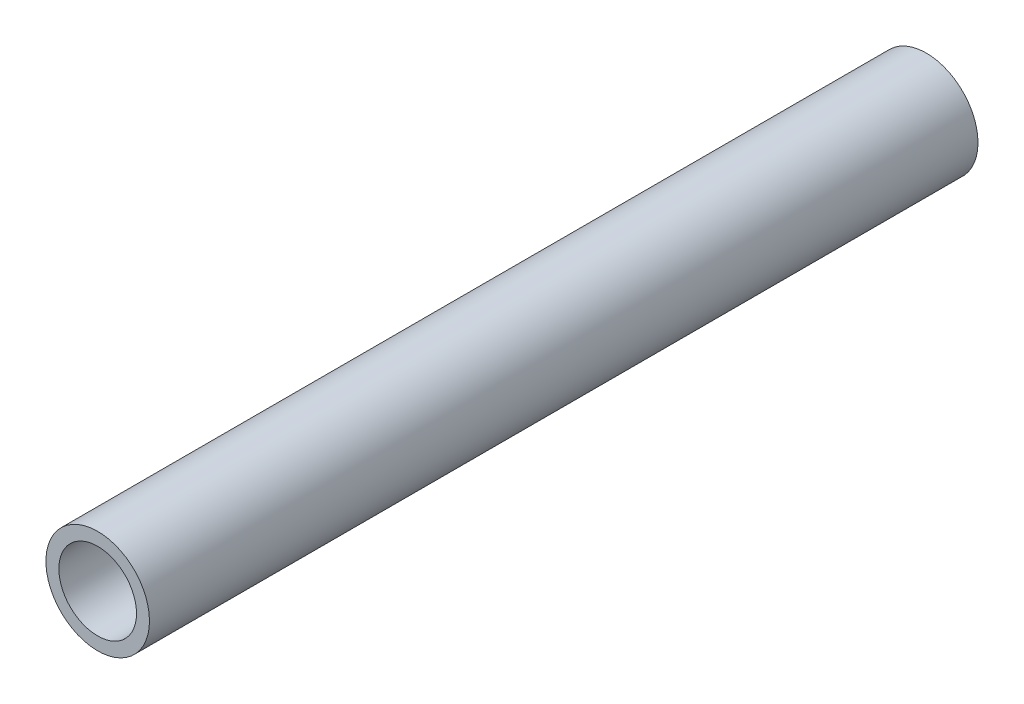
ISO-10303-21;
HEADER;
FILE_DESCRIPTION(('STEP AP214'),'2;1');
FILE_NAME('part.step','',(''),(''),'','','');
FILE_SCHEMA(('AUTOMOTIVE_DESIGN { 1 0 10303 214 1 1 1 1 }'));
ENDSEC;
DATA;
#1=APPLICATION_CONTEXT('core data for automotive mechanical design processes');
#2=APPLICATION_PROTOCOL_DEFINITION('international standard','automotive_design',2000,#1);
#3=PRODUCT_CONTEXT('',#1,'mechanical');
#4=PRODUCT('Part','Part','',(#3));
#5=PRODUCT_RELATED_PRODUCT_CATEGORY('part','',(#4));
#6=PRODUCT_DEFINITION_FORMATION('','',#4);
#7=PRODUCT_DEFINITION_CONTEXT('part definition',#1,'design');
#8=PRODUCT_DEFINITION('design','',#6,#7);
#9=PRODUCT_DEFINITION_SHAPE('','',#8);
#10=(LENGTH_UNIT() NAMED_UNIT(*) SI_UNIT(.MILLI.,.METRE.));
#11=(NAMED_UNIT(*) PLANE_ANGLE_UNIT() SI_UNIT($,.RADIAN.));
#12=(NAMED_UNIT(*) SI_UNIT($,.STERADIAN.) SOLID_ANGLE_UNIT());
#13=UNCERTAINTY_MEASURE_WITH_UNIT(LENGTH_MEASURE(1.E-05),#10,'distance_accuracy_value','');
#14=(GEOMETRIC_REPRESENTATION_CONTEXT(3) GLOBAL_UNCERTAINTY_ASSIGNED_CONTEXT((#13)) GLOBAL_UNIT_ASSIGNED_CONTEXT((#10,
#11,#12)) REPRESENTATION_CONTEXT('',''));
#15=CARTESIAN_POINT('',(0.,0.,0.));
#16=DIRECTION('',(0.,0.,1.));
#17=DIRECTION('',(1.,0.,0.));
#18=AXIS2_PLACEMENT_3D('',#15,#16,#17);
#19=CARTESIAN_POINT('',(0.,0.,50.8));
#20=DIRECTION('',(0.,0.,1.));
#21=DIRECTION('',(1.,0.,0.));
#22=AXIS2_PLACEMENT_3D('',#19,#20,#21);
#23=PLANE('',#22);
#24=CARTESIAN_POINT('',(0.,0.,50.8));
#25=DIRECTION('',(0.,0.,1.));
#26=DIRECTION('',(1.,0.,0.));
#27=AXIS2_PLACEMENT_3D('',#24,#25,#26);
#28=CIRCLE('',#27,3.175);
#29=CARTESIAN_POINT('',(3.175,0.,50.8));
#30=VERTEX_POINT('',#29);
#31=EDGE_CURVE('E10',#30,#30,#28,.T.);
#32=ORIENTED_EDGE('',*,*,#31,.T.);
#33=EDGE_LOOP('',(#32));
#34=FACE_BOUND('',#33,.T.);
#35=CARTESIAN_POINT('',(0.,0.,50.8));
#36=DIRECTION('',(0.,0.,1.));
#37=DIRECTION('',(1.,0.,0.));
#38=AXIS2_PLACEMENT_3D('',#35,#36,#37);
#39=CIRCLE('',#38,2.38125);
#40=CARTESIAN_POINT('',(2.38125,0.,50.8));
#41=VERTEX_POINT('',#40);
#42=EDGE_CURVE('E41',#41,#41,#39,.T.);
#43=ORIENTED_EDGE('',*,*,#42,.F.);
#44=EDGE_LOOP('',(#43));
#45=FACE_BOUND('',#44,.T.);
#46=ADVANCED_FACE('F30',(#34,#45),#23,.T.);
#47=CARTESIAN_POINT('',(0.,0.,0.));
#48=DIRECTION('',(0.,0.,1.));
#49=DIRECTION('',(1.,0.,0.));
#50=AXIS2_PLACEMENT_3D('',#47,#48,#49);
#51=PLANE('',#50);
#52=CARTESIAN_POINT('',(0.,0.,0.));
#53=DIRECTION('',(0.,0.,1.));
#54=DIRECTION('',(1.,0.,0.));
#55=AXIS2_PLACEMENT_3D('',#52,#53,#54);
#56=CIRCLE('',#55,3.175);
#57=CARTESIAN_POINT('',(3.175,0.,0.));
#58=VERTEX_POINT('',#57);
#59=EDGE_CURVE('E34',#58,#58,#56,.T.);
#60=ORIENTED_EDGE('',*,*,#59,.F.);
#61=EDGE_LOOP('',(#60));
#62=FACE_BOUND('',#61,.T.);
#63=CARTESIAN_POINT('',(0.,0.,0.));
#64=DIRECTION('',(0.,0.,1.));
#65=DIRECTION('',(1.,0.,0.));
#66=AXIS2_PLACEMENT_3D('',#63,#64,#65);
#67=CIRCLE('',#66,2.38125);
#68=CARTESIAN_POINT('',(2.38125,0.,0.));
#69=VERTEX_POINT('',#68);
#70=EDGE_CURVE('E43',#69,#69,#67,.T.);
#71=ORIENTED_EDGE('',*,*,#70,.T.);
#72=EDGE_LOOP('',(#71));
#73=FACE_BOUND('',#72,.T.);
#74=ADVANCED_FACE('F53',(#62,#73),#51,.F.);
#75=CARTESIAN_POINT('',(0.,0.,50.8));
#76=DIRECTION('',(0.,0.,-1.));
#77=DIRECTION('',(-1.,0.,0.));
#78=AXIS2_PLACEMENT_3D('',#75,#76,#77);
#79=CYLINDRICAL_SURFACE('',#78,3.175);
#80=ORIENTED_EDGE('',*,*,#31,.F.);
#81=EDGE_LOOP('',(#80));
#82=FACE_BOUND('',#81,.T.);
#83=ORIENTED_EDGE('',*,*,#59,.T.);
#84=EDGE_LOOP('',(#83));
#85=FACE_BOUND('',#84,.T.);
#86=ADVANCED_FACE('F32',(#82,#85),#79,.T.);
#87=CARTESIAN_POINT('',(0.,0.,50.8));
#88=DIRECTION('',(0.,0.,-1.));
#89=DIRECTION('',(-1.,0.,0.));
#90=AXIS2_PLACEMENT_3D('',#87,#88,#89);
#91=CYLINDRICAL_SURFACE('',#90,2.38125);
#92=ORIENTED_EDGE('',*,*,#42,.T.);
#93=EDGE_LOOP('',(#92));
#94=FACE_BOUND('',#93,.T.);
#95=ORIENTED_EDGE('',*,*,#70,.F.);
#96=EDGE_LOOP('',(#95));
#97=FACE_BOUND('',#96,.T.);
#98=ADVANCED_FACE('F49',(#94,#97),#91,.F.);
#99=CLOSED_SHELL('',(#46,#74,#86,#98));
#100=MANIFOLD_SOLID_BREP('B2',#99);
#101=ADVANCED_BREP_SHAPE_REPRESENTATION('',(#18,#100),#14);
#102=SHAPE_DEFINITION_REPRESENTATION(#9,#101);
ENDSEC;
END-ISO-10303-21;
